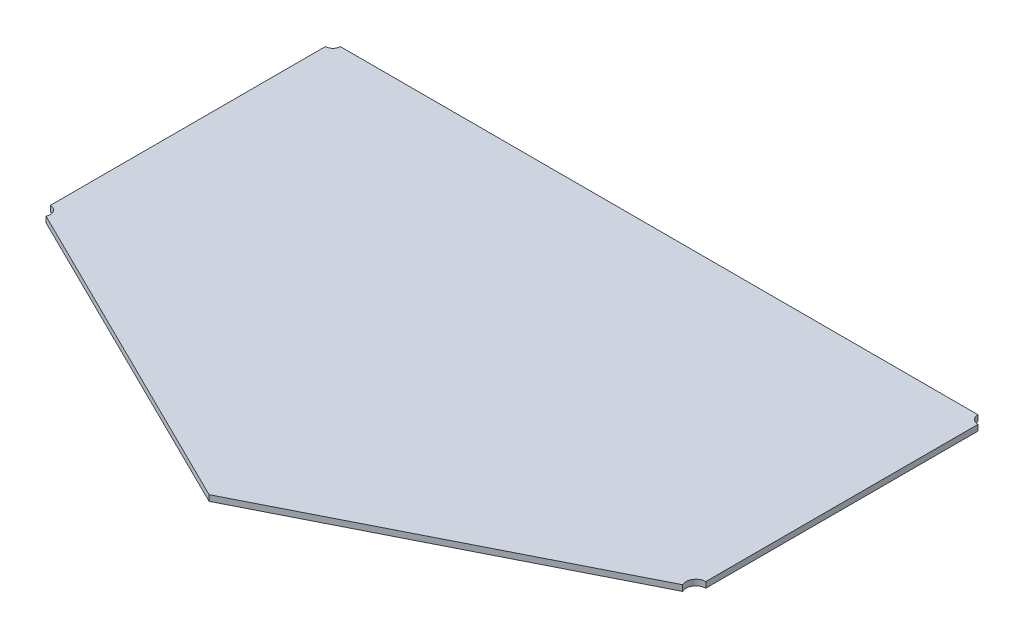
ISO-10303-21;
HEADER;
FILE_DESCRIPTION(('STEP AP214'),'2;1');
FILE_NAME('part.step','',(''),(''),'','','');
FILE_SCHEMA(('AUTOMOTIVE_DESIGN { 1 0 10303 214 1 1 1 1 }'));
ENDSEC;
DATA;
#1=APPLICATION_CONTEXT('core data for automotive mechanical design processes');
#2=APPLICATION_PROTOCOL_DEFINITION('international standard','automotive_design',2000,#1);
#3=PRODUCT_CONTEXT('',#1,'mechanical');
#4=PRODUCT('Part','Part','',(#3));
#5=PRODUCT_RELATED_PRODUCT_CATEGORY('part','',(#4));
#6=PRODUCT_DEFINITION_FORMATION('','',#4);
#7=PRODUCT_DEFINITION_CONTEXT('part definition',#1,'design');
#8=PRODUCT_DEFINITION('design','',#6,#7);
#9=PRODUCT_DEFINITION_SHAPE('','',#8);
#10=(LENGTH_UNIT() NAMED_UNIT(*) SI_UNIT(.MILLI.,.METRE.));
#11=(NAMED_UNIT(*) PLANE_ANGLE_UNIT() SI_UNIT($,.RADIAN.));
#12=(NAMED_UNIT(*) SI_UNIT($,.STERADIAN.) SOLID_ANGLE_UNIT());
#13=UNCERTAINTY_MEASURE_WITH_UNIT(LENGTH_MEASURE(1.E-05),#10,'distance_accuracy_value','');
#14=(GEOMETRIC_REPRESENTATION_CONTEXT(3) GLOBAL_UNCERTAINTY_ASSIGNED_CONTEXT((#13)) GLOBAL_UNIT_ASSIGNED_CONTEXT((#10,
#11,#12)) REPRESENTATION_CONTEXT('',''));
#15=CARTESIAN_POINT('',(0.,0.,0.));
#16=DIRECTION('',(0.,0.,1.));
#17=DIRECTION('',(1.,0.,0.));
#18=AXIS2_PLACEMENT_3D('',#15,#16,#17);
#19=CARTESIAN_POINT('',(-7.34699841162059,4.,115.158818299581));
#20=DIRECTION('',(-0.450313653695889,0.,-0.892870434774866));
#21=DIRECTION('',(-0.892870434774866,0.,0.450313653695889));
#22=AXIS2_PLACEMENT_3D('',#19,#20,#21);
#23=PLANE('',#22);
#24=DIRECTION('',(0.892870434774866,0.,-0.450313653695889));
#25=VECTOR('',#24,1.);
#26=CARTESIAN_POINT('',(-7.34699841162059,0.,115.158818299581));
#27=LINE('',#26,#25);
#28=CARTESIAN_POINT('',(-7.34699841162059,0.,115.158818299581));
#29=VERTEX_POINT('',#28);
#30=CARTESIAN_POINT('',(209.437106489864,0.,5.82510252256018));
#31=VERTEX_POINT('',#30);
#32=EDGE_CURVE('E148',#29,#31,#27,.T.);
#33=ORIENTED_EDGE('',*,*,#32,.T.);
#34=DIRECTION('',(0.,1.,0.));
#35=VECTOR('',#34,1.);
#36=CARTESIAN_POINT('',(209.437106489864,-81.,5.82510252256018));
#37=LINE('',#36,#35);
#38=CARTESIAN_POINT('',(209.437106489864,4.,5.82510252256019));
#39=VERTEX_POINT('',#38);
#40=EDGE_CURVE('E153',#31,#39,#37,.T.);
#41=ORIENTED_EDGE('',*,*,#40,.T.);
#42=DIRECTION('',(0.892870434774866,0.,-0.450313653695889));
#43=VECTOR('',#42,1.);
#44=CARTESIAN_POINT('',(-7.34699841162059,4.,115.158818299581));
#45=LINE('',#44,#43);
#46=CARTESIAN_POINT('',(-7.34699841162059,4.,115.158818299581));
#47=VERTEX_POINT('',#46);
#48=EDGE_CURVE('E167',#47,#39,#45,.T.);
#49=ORIENTED_EDGE('',*,*,#48,.F.);
#50=DIRECTION('',(0.,-1.,0.));
#51=VECTOR('',#50,1.);
#52=CARTESIAN_POINT('',(-7.34699841162059,4.,115.158818299581));
#53=LINE('',#52,#51);
#54=EDGE_CURVE('E137',#47,#29,#53,.T.);
#55=ORIENTED_EDGE('',*,*,#54,.T.);
#56=EDGE_LOOP('',(#33,#41,#49,#55));
#57=FACE_BOUND('',#56,.T.);
#58=ADVANCED_FACE('F41',(#57),#23,.F.);
#59=CARTESIAN_POINT('',(215.49560469949,4.,-197.217709806948));
#60=DIRECTION('',(-1.,0.,0.));
#61=DIRECTION('',(0.,0.,1.));
#62=AXIS2_PLACEMENT_3D('',#59,#60,#61);
#63=PLANE('',#62);
#64=DIRECTION('',(0.,0.,-1.));
#65=VECTOR('',#64,1.);
#66=CARTESIAN_POINT('',(215.49560469949,4.,-197.217709806948));
#67=LINE('',#66,#65);
#68=CARTESIAN_POINT('',(215.495604699491,4.,-4.01588037047168));
#69=VERTEX_POINT('',#68);
#70=CARTESIAN_POINT('',(215.49560469949,4.,-191.474072674264));
#71=VERTEX_POINT('',#70);
#72=EDGE_CURVE('E213',#69,#71,#67,.T.);
#73=ORIENTED_EDGE('',*,*,#72,.F.);
#74=DIRECTION('',(0.,1.,0.));
#75=VECTOR('',#74,1.);
#76=CARTESIAN_POINT('',(215.495604699491,-81.,-4.01588037047168));
#77=LINE('',#76,#75);
#78=CARTESIAN_POINT('',(215.495604699491,0.,-4.01588037047168));
#79=VERTEX_POINT('',#78);
#80=EDGE_CURVE('E204',#69,#79,#77,.F.);
#81=ORIENTED_EDGE('',*,*,#80,.T.);
#82=DIRECTION('',(0.,0.,-1.));
#83=VECTOR('',#82,1.);
#84=CARTESIAN_POINT('',(215.49560469949,0.,-197.217709806948));
#85=LINE('',#84,#83);
#86=CARTESIAN_POINT('',(215.49560469949,0.,-191.474072674264));
#87=VERTEX_POINT('',#86);
#88=EDGE_CURVE('E152',#79,#87,#85,.T.);
#89=ORIENTED_EDGE('',*,*,#88,.T.);
#90=DIRECTION('',(0.,1.,0.));
#91=VECTOR('',#90,1.);
#92=CARTESIAN_POINT('',(215.49560469949,-81.,-191.474072674264));
#93=LINE('',#92,#91);
#94=EDGE_CURVE('E56',#87,#71,#93,.T.);
#95=ORIENTED_EDGE('',*,*,#94,.T.);
#96=EDGE_LOOP('',(#73,#81,#89,#95));
#97=FACE_BOUND('',#96,.T.);
#98=ADVANCED_FACE('F232',(#97),#63,.F.);
#99=CARTESIAN_POINT('',(-234.494395300509,4.,-197.227709806948));
#100=DIRECTION('',(0.,0.,1.));
#101=DIRECTION('',(1.,0.,0.));
#102=AXIS2_PLACEMENT_3D('',#99,#100,#101);
#103=PLANE('',#102);
#104=DIRECTION('',(-1.,0.,0.));
#105=VECTOR('',#104,1.);
#106=CARTESIAN_POINT('',(-234.494395300509,4.,-197.227709806948));
#107=LINE('',#106,#105);
#108=CARTESIAN_POINT('',(209.741967566807,4.,-197.227709806948));
#109=VERTEX_POINT('',#108);
#110=CARTESIAN_POINT('',(-229.358006830457,4.,-197.227709806948));
#111=VERTEX_POINT('',#110);
#112=EDGE_CURVE('E144',#109,#111,#107,.T.);
#113=ORIENTED_EDGE('',*,*,#112,.F.);
#114=DIRECTION('',(0.,1.,0.));
#115=VECTOR('',#114,1.);
#116=CARTESIAN_POINT('',(209.741967566807,-81.,-197.227709806948));
#117=LINE('',#116,#115);
#118=CARTESIAN_POINT('',(209.741967566807,0.,-197.227709806948));
#119=VERTEX_POINT('',#118);
#120=EDGE_CURVE('E176',#109,#119,#117,.F.);
#121=ORIENTED_EDGE('',*,*,#120,.T.);
#122=DIRECTION('',(-1.,0.,0.));
#123=VECTOR('',#122,1.);
#124=CARTESIAN_POINT('',(-234.494395300509,0.,-197.227709806948));
#125=LINE('',#124,#123);
#126=CARTESIAN_POINT('',(-229.358006830457,0.,-197.227709806948));
#127=VERTEX_POINT('',#126);
#128=EDGE_CURVE('E157',#119,#127,#125,.T.);
#129=ORIENTED_EDGE('',*,*,#128,.T.);
#130=DIRECTION('',(0.,1.,0.));
#131=VECTOR('',#130,1.);
#132=CARTESIAN_POINT('',(-229.358006830457,-81.,-197.227709806948));
#133=LINE('',#132,#131);
#134=EDGE_CURVE('E64',#127,#111,#133,.T.);
#135=ORIENTED_EDGE('',*,*,#134,.T.);
#136=EDGE_LOOP('',(#113,#121,#129,#135));
#137=FACE_BOUND('',#136,.T.);
#138=ADVANCED_FACE('F183',(#137),#103,.F.);
#139=CARTESIAN_POINT('',(-234.504395300509,4.,2.76332722758152));
#140=DIRECTION('',(1.,0.,0.));
#141=DIRECTION('',(0.,0.,-1.));
#142=AXIS2_PLACEMENT_3D('',#139,#140,#141);
#143=PLANE('',#142);
#144=DIRECTION('',(0.,0.,1.));
#145=VECTOR('',#144,1.);
#146=CARTESIAN_POINT('',(-234.504395300509,4.,2.76332722758152));
#147=LINE('',#146,#145);
#148=CARTESIAN_POINT('',(-234.504395300509,4.,-192.081321336895));
#149=VERTEX_POINT('',#148);
#150=CARTESIAN_POINT('',(-234.504395300509,4.,-2.70708039179426));
#151=VERTEX_POINT('',#150);
#152=EDGE_CURVE('E131',#149,#151,#147,.T.);
#153=ORIENTED_EDGE('',*,*,#152,.F.);
#154=DIRECTION('',(0.,1.,0.));
#155=VECTOR('',#154,1.);
#156=CARTESIAN_POINT('',(-234.504395300509,-81.,-192.081321336895));
#157=LINE('',#156,#155);
#158=CARTESIAN_POINT('',(-234.504395300509,0.,-192.081321336895));
#159=VERTEX_POINT('',#158);
#160=EDGE_CURVE('E192',#149,#159,#157,.F.);
#161=ORIENTED_EDGE('',*,*,#160,.T.);
#162=DIRECTION('',(0.,0.,1.));
#163=VECTOR('',#162,1.);
#164=CARTESIAN_POINT('',(-234.504395300509,0.,2.76332722758152));
#165=LINE('',#164,#163);
#166=CARTESIAN_POINT('',(-234.504395300509,0.,-2.70708039179426));
#167=VERTEX_POINT('',#166);
#168=EDGE_CURVE('E161',#159,#167,#165,.T.);
#169=ORIENTED_EDGE('',*,*,#168,.T.);
#170=DIRECTION('',(0.,1.,0.));
#171=VECTOR('',#170,1.);
#172=CARTESIAN_POINT('',(-234.504395300509,-81.,-2.70708039179426));
#173=LINE('',#172,#171);
#174=EDGE_CURVE('E121',#167,#151,#173,.T.);
#175=ORIENTED_EDGE('',*,*,#174,.T.);
#176=EDGE_LOOP('',(#153,#161,#169,#175));
#177=FACE_BOUND('',#176,.T.);
#178=ADVANCED_FACE('F194',(#177),#143,.F.);
#179=CARTESIAN_POINT('',(-234.498829852344,4.,2.77229019305221));
#180=DIRECTION('',(0.443455183433634,0.,-0.896296547067901));
#181=DIRECTION('',(-0.896296547067901,0.,-0.443455183433633));
#182=AXIS2_PLACEMENT_3D('',#179,#180,#181);
#183=PLANE('',#182);
#184=DIRECTION('',(0.896296547067901,0.,0.443455183433633));
#185=VECTOR('',#184,1.);
#186=CARTESIAN_POINT('',(-234.498829852344,4.,2.77229019305221));
#187=LINE('',#186,#185);
#188=CARTESIAN_POINT('',(-229.595722392043,4.,5.19817080735923));
#189=VERTEX_POINT('',#188);
#190=EDGE_CURVE('E127',#189,#47,#187,.T.);
#191=ORIENTED_EDGE('',*,*,#190,.F.);
#192=DIRECTION('',(0.,1.,0.));
#193=VECTOR('',#192,1.);
#194=CARTESIAN_POINT('',(-229.595722392043,-81.,5.19817080735924));
#195=LINE('',#194,#193);
#196=CARTESIAN_POINT('',(-229.595722392043,0.,5.19817080735924));
#197=VERTEX_POINT('',#196);
#198=EDGE_CURVE('E110',#189,#197,#195,.F.);
#199=ORIENTED_EDGE('',*,*,#198,.T.);
#200=DIRECTION('',(0.896296547067901,0.,0.443455183433633));
#201=VECTOR('',#200,1.);
#202=CARTESIAN_POINT('',(-234.498829852344,0.,2.77229019305221));
#203=LINE('',#202,#201);
#204=EDGE_CURVE('E165',#197,#29,#203,.T.);
#205=ORIENTED_EDGE('',*,*,#204,.T.);
#206=ORIENTED_EDGE('',*,*,#54,.F.);
#207=EDGE_LOOP('',(#191,#199,#205,#206));
#208=FACE_BOUND('',#207,.T.);
#209=ADVANCED_FACE('F135',(#208),#183,.F.);
#210=CARTESIAN_POINT('',(215.485604699491,4.,2.76338021473257));
#211=DIRECTION('',(0.,-1.,0.));
#212=DIRECTION('',(0.,0.,-1.));
#213=AXIS2_PLACEMENT_3D('',#210,#211,#212);
#214=PLANE('',#213);
#215=ORIENTED_EDGE('',*,*,#48,.T.);
#216=CARTESIAN_POINT('',(215.485604699491,4.,2.76338021473257));
#217=DIRECTION('',(0.,1.,0.));
#218=DIRECTION('',(0.,0.,1.));
#219=AXIS2_PLACEMENT_3D('',#216,#217,#218);
#220=CIRCLE('',#219,6.77926796063586);
#221=EDGE_CURVE('E221',#69,#39,#220,.T.);
#222=ORIENTED_EDGE('',*,*,#221,.F.);
#223=ORIENTED_EDGE('',*,*,#72,.T.);
#224=CARTESIAN_POINT('',(215.48560469949,4.,-197.217709806948));
#225=DIRECTION('',(0.,1.,0.));
#226=DIRECTION('',(0.,0.,1.));
#227=AXIS2_PLACEMENT_3D('',#224,#225,#226);
#228=CIRCLE('',#227,5.74364583796224);
#229=EDGE_CURVE('E217',#109,#71,#228,.T.);
#230=ORIENTED_EDGE('',*,*,#229,.F.);
#231=ORIENTED_EDGE('',*,*,#112,.T.);
#232=CARTESIAN_POINT('',(-234.494395300509,4.,-197.217709806948));
#233=DIRECTION('',(0.,1.,0.));
#234=DIRECTION('',(0.,0.,1.));
#235=AXIS2_PLACEMENT_3D('',#232,#233,#234);
#236=CIRCLE('',#235,5.1363982045098);
#237=EDGE_CURVE('E133',#149,#111,#236,.T.);
#238=ORIENTED_EDGE('',*,*,#237,.F.);
#239=ORIENTED_EDGE('',*,*,#152,.T.);
#240=CARTESIAN_POINT('',(-234.494395300509,4.,2.76332722758153));
#241=DIRECTION('',(0.,1.,0.));
#242=DIRECTION('',(0.,0.,1.));
#243=AXIS2_PLACEMENT_3D('',#240,#241,#242);
#244=CIRCLE('',#243,5.47041675945486);
#245=EDGE_CURVE('E113',#189,#151,#244,.T.);
#246=ORIENTED_EDGE('',*,*,#245,.F.);
#247=ORIENTED_EDGE('',*,*,#190,.T.);
#248=EDGE_LOOP('',(#215,#222,#223,#230,#231,#238,#239,#246,#247));
#249=FACE_BOUND('',#248,.T.);
#250=ADVANCED_FACE('F126',(#249),#214,.F.);
#251=CARTESIAN_POINT('',(215.485604699491,0.,2.76338021473257));
#252=DIRECTION('',(0.,-1.,0.));
#253=DIRECTION('',(0.,0.,-1.));
#254=AXIS2_PLACEMENT_3D('',#251,#252,#253);
#255=PLANE('',#254);
#256=CARTESIAN_POINT('',(215.485604699491,0.,2.76338021473257));
#257=DIRECTION('',(0.,-1.,0.));
#258=DIRECTION('',(0.,0.,-1.));
#259=AXIS2_PLACEMENT_3D('',#256,#257,#258);
#260=CIRCLE('',#259,6.77926796063586);
#261=EDGE_CURVE('E11',#31,#79,#260,.T.);
#262=ORIENTED_EDGE('',*,*,#261,.F.);
#263=ORIENTED_EDGE('',*,*,#32,.F.);
#264=ORIENTED_EDGE('',*,*,#204,.F.);
#265=CARTESIAN_POINT('',(-234.494395300509,0.,2.76332722758153));
#266=DIRECTION('',(0.,-1.,0.));
#267=DIRECTION('',(0.,0.,-1.));
#268=AXIS2_PLACEMENT_3D('',#265,#266,#267);
#269=CIRCLE('',#268,5.47041675945486);
#270=EDGE_CURVE('E116',#167,#197,#269,.T.);
#271=ORIENTED_EDGE('',*,*,#270,.F.);
#272=ORIENTED_EDGE('',*,*,#168,.F.);
#273=CARTESIAN_POINT('',(-234.494395300509,0.,-197.217709806948));
#274=DIRECTION('',(0.,-1.,0.));
#275=DIRECTION('',(0.,0.,-1.));
#276=AXIS2_PLACEMENT_3D('',#273,#274,#275);
#277=CIRCLE('',#276,5.1363982045098);
#278=EDGE_CURVE('E171',#127,#159,#277,.T.);
#279=ORIENTED_EDGE('',*,*,#278,.F.);
#280=ORIENTED_EDGE('',*,*,#128,.F.);
#281=CARTESIAN_POINT('',(215.48560469949,0.,-197.217709806948));
#282=DIRECTION('',(0.,-1.,0.));
#283=DIRECTION('',(0.,0.,-1.));
#284=AXIS2_PLACEMENT_3D('',#281,#282,#283);
#285=CIRCLE('',#284,5.74364583796224);
#286=EDGE_CURVE('E49',#87,#119,#285,.T.);
#287=ORIENTED_EDGE('',*,*,#286,.F.);
#288=ORIENTED_EDGE('',*,*,#88,.F.);
#289=EDGE_LOOP('',(#262,#263,#264,#271,#272,#279,#280,#287,#288));
#290=FACE_BOUND('',#289,.T.);
#291=ADVANCED_FACE('F188',(#290),#255,.T.);
#292=CARTESIAN_POINT('',(-234.494395300509,-81.,2.76332722758153));
#293=DIRECTION('',(0.,1.,0.));
#294=DIRECTION('',(0.,0.,1.));
#295=AXIS2_PLACEMENT_3D('',#292,#293,#294);
#296=CYLINDRICAL_SURFACE('',#295,5.47041675945486);
#297=ORIENTED_EDGE('',*,*,#270,.T.);
#298=ORIENTED_EDGE('',*,*,#198,.F.);
#299=ORIENTED_EDGE('',*,*,#245,.T.);
#300=ORIENTED_EDGE('',*,*,#174,.F.);
#301=EDGE_LOOP('',(#297,#298,#299,#300));
#302=FACE_BOUND('',#301,.T.);
#303=ADVANCED_FACE('F112',(#302),#296,.F.);
#304=CARTESIAN_POINT('',(-234.494395300509,-81.,-197.217709806948));
#305=DIRECTION('',(0.,1.,0.));
#306=DIRECTION('',(0.,0.,1.));
#307=AXIS2_PLACEMENT_3D('',#304,#305,#306);
#308=CYLINDRICAL_SURFACE('',#307,5.1363982045098);
#309=ORIENTED_EDGE('',*,*,#278,.T.);
#310=ORIENTED_EDGE('',*,*,#160,.F.);
#311=ORIENTED_EDGE('',*,*,#237,.T.);
#312=ORIENTED_EDGE('',*,*,#134,.F.);
#313=EDGE_LOOP('',(#309,#310,#311,#312));
#314=FACE_BOUND('',#313,.T.);
#315=ADVANCED_FACE('F191',(#314),#308,.F.);
#316=CARTESIAN_POINT('',(215.48560469949,-81.,-197.217709806948));
#317=DIRECTION('',(0.,1.,0.));
#318=DIRECTION('',(0.,0.,1.));
#319=AXIS2_PLACEMENT_3D('',#316,#317,#318);
#320=CYLINDRICAL_SURFACE('',#319,5.74364583796224);
#321=ORIENTED_EDGE('',*,*,#286,.T.);
#322=ORIENTED_EDGE('',*,*,#120,.F.);
#323=ORIENTED_EDGE('',*,*,#229,.T.);
#324=ORIENTED_EDGE('',*,*,#94,.F.);
#325=EDGE_LOOP('',(#321,#322,#323,#324));
#326=FACE_BOUND('',#325,.T.);
#327=ADVANCED_FACE('F175',(#326),#320,.F.);
#328=CARTESIAN_POINT('',(215.485604699491,-81.,2.76338021473257));
#329=DIRECTION('',(0.,1.,0.));
#330=DIRECTION('',(0.,0.,1.));
#331=AXIS2_PLACEMENT_3D('',#328,#329,#330);
#332=CYLINDRICAL_SURFACE('',#331,6.77926796063586);
#333=ORIENTED_EDGE('',*,*,#261,.T.);
#334=ORIENTED_EDGE('',*,*,#80,.F.);
#335=ORIENTED_EDGE('',*,*,#221,.T.);
#336=ORIENTED_EDGE('',*,*,#40,.F.);
#337=EDGE_LOOP('',(#333,#334,#335,#336));
#338=FACE_BOUND('',#337,.T.);
#339=ADVANCED_FACE('F228',(#338),#332,.F.);
#340=CLOSED_SHELL('',(#58,#98,#138,#178,#209,#250,#291,#303,#315,#327,#339));
#341=MANIFOLD_SOLID_BREP('B2',#340);
#342=ADVANCED_BREP_SHAPE_REPRESENTATION('',(#18,#341),#14);
#343=SHAPE_DEFINITION_REPRESENTATION(#9,#342);
ENDSEC;
END-ISO-10303-21;
